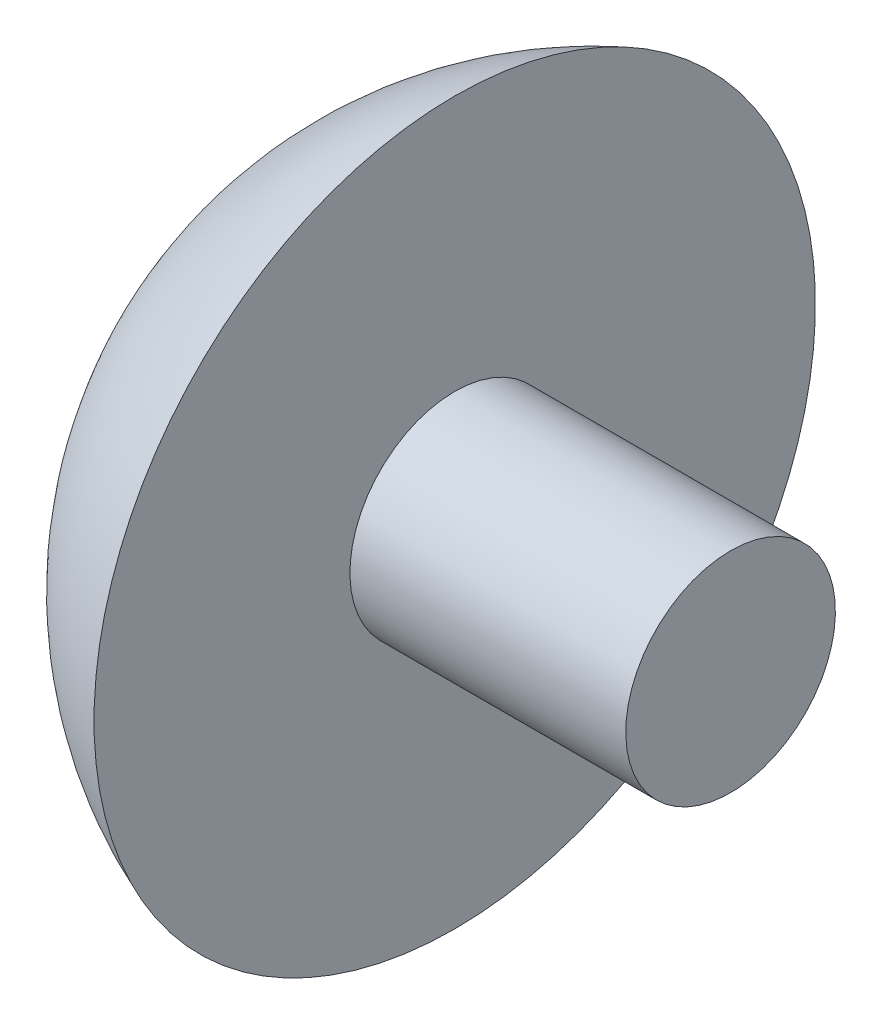
ISO-10303-21;
HEADER;
FILE_DESCRIPTION(('STEP AP214'),'2;1');
FILE_NAME('part.step','',(''),(''),'','','');
FILE_SCHEMA(('AUTOMOTIVE_DESIGN { 1 0 10303 214 1 1 1 1 }'));
ENDSEC;
DATA;
#1=APPLICATION_CONTEXT('core data for automotive mechanical design processes');
#2=APPLICATION_PROTOCOL_DEFINITION('international standard','automotive_design',2000,#1);
#3=PRODUCT_CONTEXT('',#1,'mechanical');
#4=PRODUCT('Part','Part','',(#3));
#5=PRODUCT_RELATED_PRODUCT_CATEGORY('part','',(#4));
#6=PRODUCT_DEFINITION_FORMATION('','',#4);
#7=PRODUCT_DEFINITION_CONTEXT('part definition',#1,'design');
#8=PRODUCT_DEFINITION('design','',#6,#7);
#9=PRODUCT_DEFINITION_SHAPE('','',#8);
#10=(LENGTH_UNIT() NAMED_UNIT(*) SI_UNIT(.MILLI.,.METRE.));
#11=(NAMED_UNIT(*) PLANE_ANGLE_UNIT() SI_UNIT($,.RADIAN.));
#12=(NAMED_UNIT(*) SI_UNIT($,.STERADIAN.) SOLID_ANGLE_UNIT());
#13=UNCERTAINTY_MEASURE_WITH_UNIT(LENGTH_MEASURE(1.E-05),#10,'distance_accuracy_value','');
#14=(GEOMETRIC_REPRESENTATION_CONTEXT(3) GLOBAL_UNCERTAINTY_ASSIGNED_CONTEXT((#13)) GLOBAL_UNIT_ASSIGNED_CONTEXT((#10,
#11,#12)) REPRESENTATION_CONTEXT('',''));
#15=CARTESIAN_POINT('',(0.,0.,0.));
#16=DIRECTION('',(0.,0.,1.));
#17=DIRECTION('',(1.,0.,0.));
#18=AXIS2_PLACEMENT_3D('',#15,#16,#17);
#19=CARTESIAN_POINT('',(0.,0.,0.));
#20=DIRECTION('',(-1.,0.,0.));
#21=DIRECTION('',(0.,-1.,0.));
#22=AXIS2_PLACEMENT_3D('',#19,#20,#21);
#23=PLANE('',#22);
#24=CARTESIAN_POINT('',(0.,0.,0.));
#25=DIRECTION('',(1.,0.,0.));
#26=DIRECTION('',(0.,1.,0.));
#27=AXIS2_PLACEMENT_3D('',#24,#25,#26);
#28=CIRCLE('',#27,1.9);
#29=CARTESIAN_POINT('',(0.,1.9,0.));
#30=VERTEX_POINT('',#29);
#31=EDGE_CURVE('E41',#30,#30,#28,.T.);
#32=ORIENTED_EDGE('',*,*,#31,.T.);
#33=EDGE_LOOP('',(#32));
#34=FACE_BOUND('',#33,.T.);
#35=ADVANCED_FACE('F31',(#34),#23,.F.);
#36=CARTESIAN_POINT('',(-2.5,0.,0.));
#37=DIRECTION('',(1.,0.,0.));
#38=DIRECTION('',(0.,-1.,0.));
#39=AXIS2_PLACEMENT_3D('',#36,#37,#38);
#40=SPHERICAL_SURFACE('',#39,7.);
#41=CARTESIAN_POINT('',(-5.00000000000001,0.,0.));
#42=DIRECTION('',(1.,0.,0.));
#43=DIRECTION('',(0.,1.,0.));
#44=AXIS2_PLACEMENT_3D('',#41,#42,#43);
#45=CIRCLE('',#44,6.53834841531101);
#46=CARTESIAN_POINT('',(-5.00000000000001,6.53834841531101,0.));
#47=VERTEX_POINT('',#46);
#48=EDGE_CURVE('E10',#47,#47,#45,.T.);
#49=ORIENTED_EDGE('',*,*,#48,.F.);
#50=EDGE_LOOP('',(#49));
#51=FACE_BOUND('',#50,.T.);
#52=ADVANCED_FACE('F56',(#51),#40,.T.);
#53=CARTESIAN_POINT('',(-5.,-1.9,0.));
#54=DIRECTION('',(-1.,0.,0.));
#55=DIRECTION('',(0.,-1.,0.));
#56=AXIS2_PLACEMENT_3D('',#53,#54,#55);
#57=PLANE('',#56);
#58=CARTESIAN_POINT('',(-5.,0.,0.));
#59=DIRECTION('',(1.,0.,0.));
#60=DIRECTION('',(0.,1.,0.));
#61=AXIS2_PLACEMENT_3D('',#58,#59,#60);
#62=CIRCLE('',#61,1.9);
#63=CARTESIAN_POINT('',(-5.,1.9,0.));
#64=VERTEX_POINT('',#63);
#65=EDGE_CURVE('E37',#64,#64,#62,.T.);
#66=ORIENTED_EDGE('',*,*,#65,.F.);
#67=EDGE_LOOP('',(#66));
#68=FACE_BOUND('',#67,.T.);
#69=ORIENTED_EDGE('',*,*,#48,.T.);
#70=EDGE_LOOP('',(#69));
#71=FACE_BOUND('',#70,.T.);
#72=ADVANCED_FACE('F51',(#68,#71),#57,.F.);
#73=CARTESIAN_POINT('',(0.,0.,0.));
#74=DIRECTION('',(1.,0.,0.));
#75=DIRECTION('',(0.,1.,0.));
#76=AXIS2_PLACEMENT_3D('',#73,#74,#75);
#77=CYLINDRICAL_SURFACE('',#76,1.9);
#78=ORIENTED_EDGE('',*,*,#31,.F.);
#79=EDGE_LOOP('',(#78));
#80=FACE_BOUND('',#79,.T.);
#81=ORIENTED_EDGE('',*,*,#65,.T.);
#82=EDGE_LOOP('',(#81));
#83=FACE_BOUND('',#82,.T.);
#84=ADVANCED_FACE('F49',(#80,#83),#77,.T.);
#85=CLOSED_SHELL('',(#35,#52,#72,#84));
#86=MANIFOLD_SOLID_BREP('B2',#85);
#87=ADVANCED_BREP_SHAPE_REPRESENTATION('',(#18,#86),#14);
#88=SHAPE_DEFINITION_REPRESENTATION(#9,#87);
ENDSEC;
END-ISO-10303-21;
